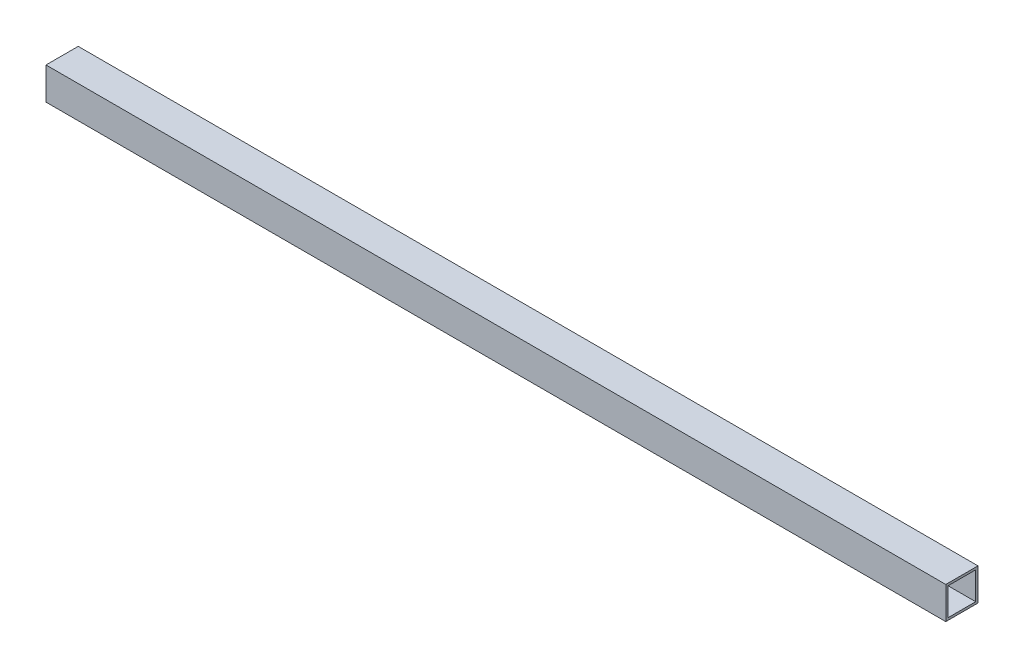
ISO-10303-21;
HEADER;
FILE_DESCRIPTION(('STEP AP214'),'2;1');
FILE_NAME('part.step','',(''),(''),'','','');
FILE_SCHEMA(('AUTOMOTIVE_DESIGN { 1 0 10303 214 1 1 1 1 }'));
ENDSEC;
DATA;
#1=APPLICATION_CONTEXT('core data for automotive mechanical design processes');
#2=APPLICATION_PROTOCOL_DEFINITION('international standard','automotive_design',2000,#1);
#3=PRODUCT_CONTEXT('',#1,'mechanical');
#4=PRODUCT('Part','Part','',(#3));
#5=PRODUCT_RELATED_PRODUCT_CATEGORY('part','',(#4));
#6=PRODUCT_DEFINITION_FORMATION('','',#4);
#7=PRODUCT_DEFINITION_CONTEXT('part definition',#1,'design');
#8=PRODUCT_DEFINITION('design','',#6,#7);
#9=PRODUCT_DEFINITION_SHAPE('','',#8);
#10=(LENGTH_UNIT() NAMED_UNIT(*) SI_UNIT(.MILLI.,.METRE.));
#11=(NAMED_UNIT(*) PLANE_ANGLE_UNIT() SI_UNIT($,.RADIAN.));
#12=(NAMED_UNIT(*) SI_UNIT($,.STERADIAN.) SOLID_ANGLE_UNIT());
#13=UNCERTAINTY_MEASURE_WITH_UNIT(LENGTH_MEASURE(1.E-05),#10,'distance_accuracy_value','');
#14=(GEOMETRIC_REPRESENTATION_CONTEXT(3) GLOBAL_UNCERTAINTY_ASSIGNED_CONTEXT((#13)) GLOBAL_UNIT_ASSIGNED_CONTEXT((#10,
#11,#12)) REPRESENTATION_CONTEXT('',''));
#15=CARTESIAN_POINT('',(0.,0.,0.));
#16=DIRECTION('',(0.,0.,1.));
#17=DIRECTION('',(1.,0.,0.));
#18=AXIS2_PLACEMENT_3D('',#15,#16,#17);
#19=CARTESIAN_POINT('',(-620.7125,-22.225,22.225));
#20=DIRECTION('',(0.,-1.,0.));
#21=DIRECTION('',(0.,0.,-1.));
#22=AXIS2_PLACEMENT_3D('',#19,#20,#21);
#23=PLANE('',#22);
#24=DIRECTION('',(1.,0.,0.));
#25=VECTOR('',#24,1.);
#26=CARTESIAN_POINT('',(-620.7125,-22.225,22.225));
#27=LINE('',#26,#25);
#28=CARTESIAN_POINT('',(-620.7125,-22.225,22.225));
#29=VERTEX_POINT('',#28);
#30=CARTESIAN_POINT('',(620.7125,-22.225,22.225));
#31=VERTEX_POINT('',#30);
#32=EDGE_CURVE('E114',#29,#31,#27,.T.);
#33=ORIENTED_EDGE('',*,*,#32,.F.);
#34=DIRECTION('',(0.,0.,-1.));
#35=VECTOR('',#34,1.);
#36=CARTESIAN_POINT('',(-620.7125,-22.225,0.));
#37=LINE('',#36,#35);
#38=CARTESIAN_POINT('',(-620.7125,-22.225,-22.225));
#39=VERTEX_POINT('',#38);
#40=EDGE_CURVE('E136',#29,#39,#37,.T.);
#41=ORIENTED_EDGE('',*,*,#40,.T.);
#42=DIRECTION('',(-1.,0.,0.));
#43=VECTOR('',#42,1.);
#44=CARTESIAN_POINT('',(-620.7125,-22.225,-22.225));
#45=LINE('',#44,#43);
#46=CARTESIAN_POINT('',(620.7125,-22.225,-22.225));
#47=VERTEX_POINT('',#46);
#48=EDGE_CURVE('E131',#47,#39,#45,.T.);
#49=ORIENTED_EDGE('',*,*,#48,.F.);
#50=DIRECTION('',(0.,0.,-1.));
#51=VECTOR('',#50,1.);
#52=CARTESIAN_POINT('',(620.7125,-22.225,0.));
#53=LINE('',#52,#51);
#54=EDGE_CURVE('E106',#31,#47,#53,.T.);
#55=ORIENTED_EDGE('',*,*,#54,.F.);
#56=EDGE_LOOP('',(#33,#41,#49,#55));
#57=FACE_BOUND('',#56,.T.);
#58=ADVANCED_FACE('F17',(#57),#23,.T.);
#59=CARTESIAN_POINT('',(-620.7125,19.05,-19.05));
#60=DIRECTION('',(0.,0.,1.));
#61=DIRECTION('',(1.,0.,0.));
#62=AXIS2_PLACEMENT_3D('',#59,#60,#61);
#63=PLANE('',#62);
#64=DIRECTION('',(1.,0.,0.));
#65=VECTOR('',#64,1.);
#66=CARTESIAN_POINT('',(-620.7125,19.05,-19.05));
#67=LINE('',#66,#65);
#68=CARTESIAN_POINT('',(-620.7125,19.05,-19.05));
#69=VERTEX_POINT('',#68);
#70=CARTESIAN_POINT('',(620.7125,19.05,-19.05));
#71=VERTEX_POINT('',#70);
#72=EDGE_CURVE('E91',#69,#71,#67,.T.);
#73=ORIENTED_EDGE('',*,*,#72,.F.);
#74=DIRECTION('',(0.,1.,0.));
#75=VECTOR('',#74,1.);
#76=CARTESIAN_POINT('',(-620.7125,0.,-19.05));
#77=LINE('',#76,#75);
#78=CARTESIAN_POINT('',(-620.7125,-19.05,-19.05));
#79=VERTEX_POINT('',#78);
#80=EDGE_CURVE('E139',#69,#79,#77,.F.);
#81=ORIENTED_EDGE('',*,*,#80,.T.);
#82=DIRECTION('',(1.,0.,0.));
#83=VECTOR('',#82,1.);
#84=CARTESIAN_POINT('',(-620.7125,-19.05,-19.05));
#85=LINE('',#84,#83);
#86=CARTESIAN_POINT('',(620.7125,-19.05,-19.05));
#87=VERTEX_POINT('',#86);
#88=EDGE_CURVE('E20',#87,#79,#85,.F.);
#89=ORIENTED_EDGE('',*,*,#88,.F.);
#90=DIRECTION('',(0.,1.,0.));
#91=VECTOR('',#90,1.);
#92=CARTESIAN_POINT('',(620.7125,0.,-19.05));
#93=LINE('',#92,#91);
#94=EDGE_CURVE('E105',#71,#87,#93,.F.);
#95=ORIENTED_EDGE('',*,*,#94,.F.);
#96=EDGE_LOOP('',(#73,#81,#89,#95));
#97=FACE_BOUND('',#96,.T.);
#98=ADVANCED_FACE('F125',(#97),#63,.T.);
#99=CARTESIAN_POINT('',(-620.7125,-19.05,-19.05));
#100=DIRECTION('',(0.,1.,0.));
#101=DIRECTION('',(0.,0.,1.));
#102=AXIS2_PLACEMENT_3D('',#99,#100,#101);
#103=PLANE('',#102);
#104=ORIENTED_EDGE('',*,*,#88,.T.);
#105=DIRECTION('',(0.,0.,-1.));
#106=VECTOR('',#105,1.);
#107=CARTESIAN_POINT('',(-620.7125,-19.05,0.));
#108=LINE('',#107,#106);
#109=CARTESIAN_POINT('',(-620.7125,-19.05,19.05));
#110=VERTEX_POINT('',#109);
#111=EDGE_CURVE('E88',#79,#110,#108,.F.);
#112=ORIENTED_EDGE('',*,*,#111,.T.);
#113=DIRECTION('',(-1.,0.,0.));
#114=VECTOR('',#113,1.);
#115=CARTESIAN_POINT('',(-620.7125,-19.05,19.05));
#116=LINE('',#115,#114);
#117=CARTESIAN_POINT('',(620.7125,-19.05,19.05));
#118=VERTEX_POINT('',#117);
#119=EDGE_CURVE('E80',#118,#110,#116,.T.);
#120=ORIENTED_EDGE('',*,*,#119,.F.);
#121=DIRECTION('',(0.,0.,-1.));
#122=VECTOR('',#121,1.);
#123=CARTESIAN_POINT('',(620.7125,-19.05,0.));
#124=LINE('',#123,#122);
#125=EDGE_CURVE('E85',#87,#118,#124,.F.);
#126=ORIENTED_EDGE('',*,*,#125,.F.);
#127=EDGE_LOOP('',(#104,#112,#120,#126));
#128=FACE_BOUND('',#127,.T.);
#129=ADVANCED_FACE('F83',(#128),#103,.T.);
#130=CARTESIAN_POINT('',(-620.7125,-19.05,19.05));
#131=DIRECTION('',(0.,0.,-1.));
#132=DIRECTION('',(-1.,0.,0.));
#133=AXIS2_PLACEMENT_3D('',#130,#131,#132);
#134=PLANE('',#133);
#135=ORIENTED_EDGE('',*,*,#119,.T.);
#136=DIRECTION('',(0.,1.,0.));
#137=VECTOR('',#136,1.);
#138=CARTESIAN_POINT('',(-620.7125,0.,19.05));
#139=LINE('',#138,#137);
#140=CARTESIAN_POINT('',(-620.7125,19.05,19.05));
#141=VERTEX_POINT('',#140);
#142=EDGE_CURVE('E142',#110,#141,#139,.T.);
#143=ORIENTED_EDGE('',*,*,#142,.T.);
#144=DIRECTION('',(1.,0.,0.));
#145=VECTOR('',#144,1.);
#146=CARTESIAN_POINT('',(-620.7125,19.05,19.05));
#147=LINE('',#146,#145);
#148=CARTESIAN_POINT('',(620.7125,19.05,19.05));
#149=VERTEX_POINT('',#148);
#150=EDGE_CURVE('E96',#149,#141,#147,.F.);
#151=ORIENTED_EDGE('',*,*,#150,.F.);
#152=DIRECTION('',(0.,1.,0.));
#153=VECTOR('',#152,1.);
#154=CARTESIAN_POINT('',(620.7125,0.,19.05));
#155=LINE('',#154,#153);
#156=EDGE_CURVE('E93',#118,#149,#155,.T.);
#157=ORIENTED_EDGE('',*,*,#156,.F.);
#158=EDGE_LOOP('',(#135,#143,#151,#157));
#159=FACE_BOUND('',#158,.T.);
#160=ADVANCED_FACE('F94',(#159),#134,.T.);
#161=CARTESIAN_POINT('',(-620.7125,19.05,19.05));
#162=DIRECTION('',(0.,-1.,0.));
#163=DIRECTION('',(0.,0.,-1.));
#164=AXIS2_PLACEMENT_3D('',#161,#162,#163);
#165=PLANE('',#164);
#166=ORIENTED_EDGE('',*,*,#150,.T.);
#167=DIRECTION('',(0.,0.,-1.));
#168=VECTOR('',#167,1.);
#169=CARTESIAN_POINT('',(-620.7125,19.05,0.));
#170=LINE('',#169,#168);
#171=EDGE_CURVE('E122',#141,#69,#170,.T.);
#172=ORIENTED_EDGE('',*,*,#171,.T.);
#173=ORIENTED_EDGE('',*,*,#72,.T.);
#174=DIRECTION('',(0.,0.,-1.));
#175=VECTOR('',#174,1.);
#176=CARTESIAN_POINT('',(620.7125,19.05,0.));
#177=LINE('',#176,#175);
#178=EDGE_CURVE('E100',#149,#71,#177,.T.);
#179=ORIENTED_EDGE('',*,*,#178,.F.);
#180=EDGE_LOOP('',(#166,#172,#173,#179));
#181=FACE_BOUND('',#180,.T.);
#182=ADVANCED_FACE('F120',(#181),#165,.T.);
#183=CARTESIAN_POINT('',(-620.7125,22.225,22.225));
#184=DIRECTION('',(0.,0.,1.));
#185=DIRECTION('',(1.,0.,0.));
#186=AXIS2_PLACEMENT_3D('',#183,#184,#185);
#187=PLANE('',#186);
#188=DIRECTION('',(1.,0.,0.));
#189=VECTOR('',#188,1.);
#190=CARTESIAN_POINT('',(-620.7125,22.225,22.225));
#191=LINE('',#190,#189);
#192=CARTESIAN_POINT('',(-620.7125,22.225,22.225));
#193=VERTEX_POINT('',#192);
#194=CARTESIAN_POINT('',(620.7125,22.225,22.225));
#195=VERTEX_POINT('',#194);
#196=EDGE_CURVE('E145',#193,#195,#191,.T.);
#197=ORIENTED_EDGE('',*,*,#196,.F.);
#198=DIRECTION('',(0.,1.,0.));
#199=VECTOR('',#198,1.);
#200=CARTESIAN_POINT('',(-620.7125,0.,22.225));
#201=LINE('',#200,#199);
#202=EDGE_CURVE('E133',#193,#29,#201,.F.);
#203=ORIENTED_EDGE('',*,*,#202,.T.);
#204=ORIENTED_EDGE('',*,*,#32,.T.);
#205=DIRECTION('',(0.,1.,0.));
#206=VECTOR('',#205,1.);
#207=CARTESIAN_POINT('',(620.7125,0.,22.225));
#208=LINE('',#207,#206);
#209=EDGE_CURVE('E108',#195,#31,#208,.F.);
#210=ORIENTED_EDGE('',*,*,#209,.F.);
#211=EDGE_LOOP('',(#197,#203,#204,#210));
#212=FACE_BOUND('',#211,.T.);
#213=ADVANCED_FACE('F164',(#212),#187,.T.);
#214=CARTESIAN_POINT('',(620.7125,0.,0.));
#215=DIRECTION('',(1.,0.,0.));
#216=DIRECTION('',(0.,0.,-1.));
#217=AXIS2_PLACEMENT_3D('',#214,#215,#216);
#218=PLANE('',#217);
#219=ORIENTED_EDGE('',*,*,#178,.T.);
#220=ORIENTED_EDGE('',*,*,#94,.T.);
#221=ORIENTED_EDGE('',*,*,#125,.T.);
#222=ORIENTED_EDGE('',*,*,#156,.T.);
#223=EDGE_LOOP('',(#219,#220,#221,#222));
#224=FACE_BOUND('',#223,.T.);
#225=DIRECTION('',(0.,1.,0.));
#226=VECTOR('',#225,1.);
#227=CARTESIAN_POINT('',(620.7125,-22.225,-22.225));
#228=LINE('',#227,#226);
#229=CARTESIAN_POINT('',(620.7125,22.225,-22.225));
#230=VERTEX_POINT('',#229);
#231=EDGE_CURVE('E126',#230,#47,#228,.F.);
#232=ORIENTED_EDGE('',*,*,#231,.F.);
#233=DIRECTION('',(0.,0.,1.));
#234=VECTOR('',#233,1.);
#235=CARTESIAN_POINT('',(620.7125,22.225,-22.225));
#236=LINE('',#235,#234);
#237=EDGE_CURVE('E148',#195,#230,#236,.F.);
#238=ORIENTED_EDGE('',*,*,#237,.F.);
#239=ORIENTED_EDGE('',*,*,#209,.T.);
#240=ORIENTED_EDGE('',*,*,#54,.T.);
#241=EDGE_LOOP('',(#232,#238,#239,#240));
#242=FACE_BOUND('',#241,.T.);
#243=ADVANCED_FACE('F102',(#224,#242),#218,.T.);
#244=CARTESIAN_POINT('',(-620.7125,-22.225,-22.225));
#245=DIRECTION('',(0.,0.,-1.));
#246=DIRECTION('',(-1.,0.,0.));
#247=AXIS2_PLACEMENT_3D('',#244,#245,#246);
#248=PLANE('',#247);
#249=ORIENTED_EDGE('',*,*,#48,.T.);
#250=DIRECTION('',(0.,1.,0.));
#251=VECTOR('',#250,1.);
#252=CARTESIAN_POINT('',(-620.7125,0.,-22.225));
#253=LINE('',#252,#251);
#254=CARTESIAN_POINT('',(-620.7125,22.225,-22.225));
#255=VERTEX_POINT('',#254);
#256=EDGE_CURVE('E35',#39,#255,#253,.T.);
#257=ORIENTED_EDGE('',*,*,#256,.T.);
#258=DIRECTION('',(1.,0.,0.));
#259=VECTOR('',#258,1.);
#260=CARTESIAN_POINT('',(-620.7125,22.225,-22.225));
#261=LINE('',#260,#259);
#262=EDGE_CURVE('E26',#230,#255,#261,.F.);
#263=ORIENTED_EDGE('',*,*,#262,.F.);
#264=ORIENTED_EDGE('',*,*,#231,.T.);
#265=EDGE_LOOP('',(#249,#257,#263,#264));
#266=FACE_BOUND('',#265,.T.);
#267=ADVANCED_FACE('F155',(#266),#248,.T.);
#268=CARTESIAN_POINT('',(-620.7125,0.,0.));
#269=DIRECTION('',(1.,0.,0.));
#270=DIRECTION('',(0.,0.,-1.));
#271=AXIS2_PLACEMENT_3D('',#268,#269,#270);
#272=PLANE('',#271);
#273=ORIENTED_EDGE('',*,*,#142,.F.);
#274=ORIENTED_EDGE('',*,*,#111,.F.);
#275=ORIENTED_EDGE('',*,*,#80,.F.);
#276=ORIENTED_EDGE('',*,*,#171,.F.);
#277=EDGE_LOOP('',(#273,#274,#275,#276));
#278=FACE_BOUND('',#277,.T.);
#279=ORIENTED_EDGE('',*,*,#40,.F.);
#280=ORIENTED_EDGE('',*,*,#202,.F.);
#281=DIRECTION('',(0.,0.,1.));
#282=VECTOR('',#281,1.);
#283=CARTESIAN_POINT('',(-620.7125,22.225,-22.225));
#284=LINE('',#283,#282);
#285=EDGE_CURVE('E11',#255,#193,#284,.T.);
#286=ORIENTED_EDGE('',*,*,#285,.F.);
#287=ORIENTED_EDGE('',*,*,#256,.F.);
#288=EDGE_LOOP('',(#279,#280,#286,#287));
#289=FACE_BOUND('',#288,.T.);
#290=ADVANCED_FACE('F162',(#278,#289),#272,.F.);
#291=CARTESIAN_POINT('',(-620.7125,22.225,-22.225));
#292=DIRECTION('',(0.,1.,0.));
#293=DIRECTION('',(0.,0.,1.));
#294=AXIS2_PLACEMENT_3D('',#291,#292,#293);
#295=PLANE('',#294);
#296=ORIENTED_EDGE('',*,*,#262,.T.);
#297=ORIENTED_EDGE('',*,*,#285,.T.);
#298=ORIENTED_EDGE('',*,*,#196,.T.);
#299=ORIENTED_EDGE('',*,*,#237,.T.);
#300=EDGE_LOOP('',(#296,#297,#298,#299));
#301=FACE_BOUND('',#300,.T.);
#302=ADVANCED_FACE('F153',(#301),#295,.T.);
#303=CLOSED_SHELL('',(#58,#98,#129,#160,#182,#213,#243,#267,#290,#302));
#304=MANIFOLD_SOLID_BREP('B1',#303);
#305=ADVANCED_BREP_SHAPE_REPRESENTATION('',(#18,#304),#14);
#306=SHAPE_DEFINITION_REPRESENTATION(#9,#305);
ENDSEC;
END-ISO-10303-21;
